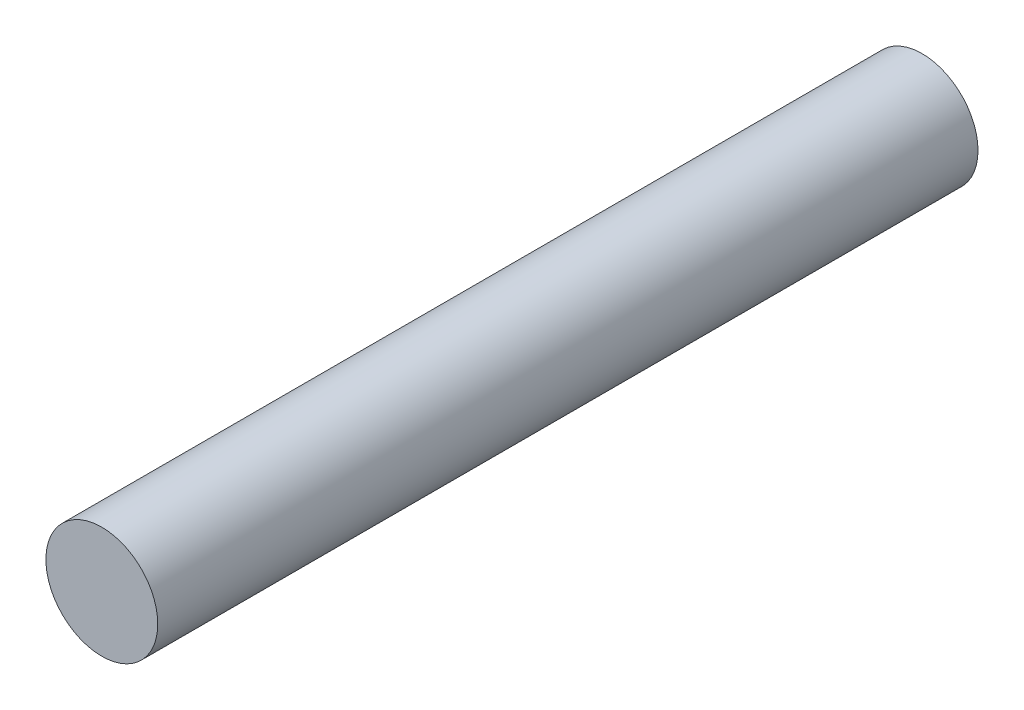
ISO-10303-21;
HEADER;
FILE_DESCRIPTION(('STEP AP214'),'2;1');
FILE_NAME('part.step','',(''),(''),'','','');
FILE_SCHEMA(('AUTOMOTIVE_DESIGN { 1 0 10303 214 1 1 1 1 }'));
ENDSEC;
DATA;
#1=APPLICATION_CONTEXT('core data for automotive mechanical design processes');
#2=APPLICATION_PROTOCOL_DEFINITION('international standard','automotive_design',2000,#1);
#3=PRODUCT_CONTEXT('',#1,'mechanical');
#4=PRODUCT('Part','Part','',(#3));
#5=PRODUCT_RELATED_PRODUCT_CATEGORY('part','',(#4));
#6=PRODUCT_DEFINITION_FORMATION('','',#4);
#7=PRODUCT_DEFINITION_CONTEXT('part definition',#1,'design');
#8=PRODUCT_DEFINITION('design','',#6,#7);
#9=PRODUCT_DEFINITION_SHAPE('','',#8);
#10=(LENGTH_UNIT() NAMED_UNIT(*) SI_UNIT(.MILLI.,.METRE.));
#11=(NAMED_UNIT(*) PLANE_ANGLE_UNIT() SI_UNIT($,.RADIAN.));
#12=(NAMED_UNIT(*) SI_UNIT($,.STERADIAN.) SOLID_ANGLE_UNIT());
#13=UNCERTAINTY_MEASURE_WITH_UNIT(LENGTH_MEASURE(1.E-05),#10,'distance_accuracy_value','');
#14=(GEOMETRIC_REPRESENTATION_CONTEXT(3) GLOBAL_UNCERTAINTY_ASSIGNED_CONTEXT((#13)) GLOBAL_UNIT_ASSIGNED_CONTEXT((#10,
#11,#12)) REPRESENTATION_CONTEXT('',''));
#15=CARTESIAN_POINT('',(0.,0.,0.));
#16=DIRECTION('',(0.,0.,1.));
#17=DIRECTION('',(1.,0.,0.));
#18=AXIS2_PLACEMENT_3D('',#15,#16,#17);
#19=CARTESIAN_POINT('',(0.,0.,27.5));
#20=DIRECTION('',(0.,0.,-1.));
#21=DIRECTION('',(-1.,0.,0.));
#22=AXIS2_PLACEMENT_3D('',#19,#20,#21);
#23=CYLINDRICAL_SURFACE('',#22,3.75);
#24=CARTESIAN_POINT('',(0.,0.,27.5));
#25=DIRECTION('',(0.,0.,1.));
#26=DIRECTION('',(1.,0.,0.));
#27=AXIS2_PLACEMENT_3D('',#24,#25,#26);
#28=CIRCLE('',#27,3.75);
#29=CARTESIAN_POINT('',(3.75,0.,27.5));
#30=VERTEX_POINT('',#29);
#31=EDGE_CURVE('E10',#30,#30,#28,.T.);
#32=ORIENTED_EDGE('',*,*,#31,.F.);
#33=EDGE_LOOP('',(#32));
#34=FACE_BOUND('',#33,.T.);
#35=CARTESIAN_POINT('',(0.,0.,-27.5));
#36=DIRECTION('',(0.,0.,1.));
#37=DIRECTION('',(1.,0.,0.));
#38=AXIS2_PLACEMENT_3D('',#35,#36,#37);
#39=CIRCLE('',#38,3.75);
#40=CARTESIAN_POINT('',(3.75,0.,-27.5));
#41=VERTEX_POINT('',#40);
#42=EDGE_CURVE('E43',#41,#41,#39,.T.);
#43=ORIENTED_EDGE('',*,*,#42,.T.);
#44=EDGE_LOOP('',(#43));
#45=FACE_BOUND('',#44,.T.);
#46=ADVANCED_FACE('F40',(#34,#45),#23,.T.);
#47=CARTESIAN_POINT('',(0.,0.,27.5));
#48=DIRECTION('',(0.,0.,1.));
#49=DIRECTION('',(1.,0.,0.));
#50=AXIS2_PLACEMENT_3D('',#47,#48,#49);
#51=PLANE('',#50);
#52=ORIENTED_EDGE('',*,*,#31,.T.);
#53=EDGE_LOOP('',(#52));
#54=FACE_BOUND('',#53,.T.);
#55=ADVANCED_FACE('F61',(#54),#51,.T.);
#56=CARTESIAN_POINT('',(0.,0.,-27.5));
#57=DIRECTION('',(0.,0.,1.));
#58=DIRECTION('',(1.,0.,0.));
#59=AXIS2_PLACEMENT_3D('',#56,#57,#58);
#60=PLANE('',#59);
#61=ORIENTED_EDGE('',*,*,#42,.F.);
#62=EDGE_LOOP('',(#61));
#63=FACE_BOUND('',#62,.T.);
#64=ADVANCED_FACE('F59',(#63),#60,.F.);
#65=CLOSED_SHELL('',(#46,#55,#64));
#66=MANIFOLD_SOLID_BREP('B2',#65);
#67=ADVANCED_BREP_SHAPE_REPRESENTATION('',(#18,#66),#14);
#68=SHAPE_DEFINITION_REPRESENTATION(#9,#67);
ENDSEC;
END-ISO-10303-21;
